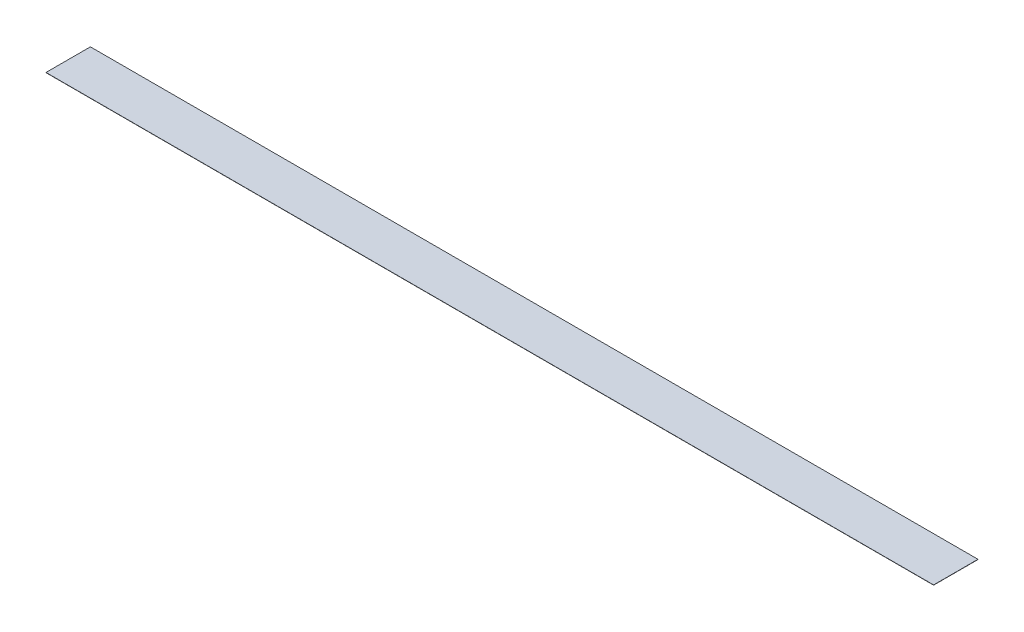
ISO-10303-21;
HEADER;
FILE_DESCRIPTION(('STEP AP214'),'2;1');
FILE_NAME('part.step','',(''),(''),'','','');
FILE_SCHEMA(('AUTOMOTIVE_DESIGN { 1 0 10303 214 1 1 1 1 }'));
ENDSEC;
DATA;
#1=APPLICATION_CONTEXT('core data for automotive mechanical design processes');
#2=APPLICATION_PROTOCOL_DEFINITION('international standard','automotive_design',2000,#1);
#3=PRODUCT_CONTEXT('',#1,'mechanical');
#4=PRODUCT('Part','Part','',(#3));
#5=PRODUCT_RELATED_PRODUCT_CATEGORY('part','',(#4));
#6=PRODUCT_DEFINITION_FORMATION('','',#4);
#7=PRODUCT_DEFINITION_CONTEXT('part definition',#1,'design');
#8=PRODUCT_DEFINITION('design','',#6,#7);
#9=PRODUCT_DEFINITION_SHAPE('','',#8);
#10=(LENGTH_UNIT() NAMED_UNIT(*) SI_UNIT(.MILLI.,.METRE.));
#11=(NAMED_UNIT(*) PLANE_ANGLE_UNIT() SI_UNIT($,.RADIAN.));
#12=(NAMED_UNIT(*) SI_UNIT($,.STERADIAN.) SOLID_ANGLE_UNIT());
#13=UNCERTAINTY_MEASURE_WITH_UNIT(LENGTH_MEASURE(1.E-05),#10,'distance_accuracy_value','');
#14=(GEOMETRIC_REPRESENTATION_CONTEXT(3) GLOBAL_UNCERTAINTY_ASSIGNED_CONTEXT((#13)) GLOBAL_UNIT_ASSIGNED_CONTEXT((#10,
#11,#12)) REPRESENTATION_CONTEXT('',''));
#15=CARTESIAN_POINT('',(0.,0.,0.));
#16=DIRECTION('',(0.,0.,1.));
#17=DIRECTION('',(1.,0.,0.));
#18=AXIS2_PLACEMENT_3D('',#15,#16,#17);
#19=CARTESIAN_POINT('',(508.,0.254,-25.4));
#20=DIRECTION('',(-1.,0.,0.));
#21=DIRECTION('',(0.,0.,1.));
#22=AXIS2_PLACEMENT_3D('',#19,#20,#21);
#23=PLANE('',#22);
#24=DIRECTION('',(0.,0.,-1.));
#25=VECTOR('',#24,1.);
#26=CARTESIAN_POINT('',(508.,0.,-25.4));
#27=LINE('',#26,#25);
#28=CARTESIAN_POINT('',(508.,0.,25.4));
#29=VERTEX_POINT('',#28);
#30=CARTESIAN_POINT('',(508.,0.,-25.4));
#31=VERTEX_POINT('',#30);
#32=EDGE_CURVE('E100',#29,#31,#27,.T.);
#33=ORIENTED_EDGE('',*,*,#32,.T.);
#34=DIRECTION('',(0.,-1.,0.));
#35=VECTOR('',#34,1.);
#36=CARTESIAN_POINT('',(508.,0.254,-25.4));
#37=LINE('',#36,#35);
#38=CARTESIAN_POINT('',(508.,0.254,-25.4));
#39=VERTEX_POINT('',#38);
#40=EDGE_CURVE('E11',#39,#31,#37,.T.);
#41=ORIENTED_EDGE('',*,*,#40,.F.);
#42=DIRECTION('',(0.,0.,-1.));
#43=VECTOR('',#42,1.);
#44=CARTESIAN_POINT('',(508.,0.254,-25.4));
#45=LINE('',#44,#43);
#46=CARTESIAN_POINT('',(508.,0.254,25.4));
#47=VERTEX_POINT('',#46);
#48=EDGE_CURVE('E88',#47,#39,#45,.T.);
#49=ORIENTED_EDGE('',*,*,#48,.F.);
#50=DIRECTION('',(0.,-1.,0.));
#51=VECTOR('',#50,1.);
#52=CARTESIAN_POINT('',(508.,0.254,25.4));
#53=LINE('',#52,#51);
#54=EDGE_CURVE('E96',#47,#29,#53,.T.);
#55=ORIENTED_EDGE('',*,*,#54,.T.);
#56=EDGE_LOOP('',(#33,#41,#49,#55));
#57=FACE_BOUND('',#56,.T.);
#58=ADVANCED_FACE('F37',(#57),#23,.F.);
#59=CARTESIAN_POINT('',(-508.,0.254,-25.4));
#60=DIRECTION('',(0.,0.,1.));
#61=DIRECTION('',(1.,0.,0.));
#62=AXIS2_PLACEMENT_3D('',#59,#60,#61);
#63=PLANE('',#62);
#64=DIRECTION('',(-1.,0.,0.));
#65=VECTOR('',#64,1.);
#66=CARTESIAN_POINT('',(-508.,0.,-25.4));
#67=LINE('',#66,#65);
#68=CARTESIAN_POINT('',(-508.,0.,-25.4));
#69=VERTEX_POINT('',#68);
#70=EDGE_CURVE('E92',#31,#69,#67,.T.);
#71=ORIENTED_EDGE('',*,*,#70,.T.);
#72=DIRECTION('',(0.,-1.,0.));
#73=VECTOR('',#72,1.);
#74=CARTESIAN_POINT('',(-508.,0.254,-25.4));
#75=LINE('',#74,#73);
#76=CARTESIAN_POINT('',(-508.,0.254,-25.4));
#77=VERTEX_POINT('',#76);
#78=EDGE_CURVE('E45',#77,#69,#75,.T.);
#79=ORIENTED_EDGE('',*,*,#78,.F.);
#80=DIRECTION('',(-1.,0.,0.));
#81=VECTOR('',#80,1.);
#82=CARTESIAN_POINT('',(-508.,0.254,-25.4));
#83=LINE('',#82,#81);
#84=EDGE_CURVE('E83',#39,#77,#83,.T.);
#85=ORIENTED_EDGE('',*,*,#84,.F.);
#86=ORIENTED_EDGE('',*,*,#40,.T.);
#87=EDGE_LOOP('',(#71,#79,#85,#86));
#88=FACE_BOUND('',#87,.T.);
#89=ADVANCED_FACE('F91',(#88),#63,.F.);
#90=CARTESIAN_POINT('',(-508.,0.254,-25.4));
#91=DIRECTION('',(1.,0.,0.));
#92=DIRECTION('',(0.,0.,-1.));
#93=AXIS2_PLACEMENT_3D('',#90,#91,#92);
#94=PLANE('',#93);
#95=DIRECTION('',(0.,0.,1.));
#96=VECTOR('',#95,1.);
#97=CARTESIAN_POINT('',(-508.,0.,-25.4));
#98=LINE('',#97,#96);
#99=CARTESIAN_POINT('',(-508.,0.,25.4));
#100=VERTEX_POINT('',#99);
#101=EDGE_CURVE('E70',#69,#100,#98,.T.);
#102=ORIENTED_EDGE('',*,*,#101,.T.);
#103=DIRECTION('',(0.,-1.,0.));
#104=VECTOR('',#103,1.);
#105=CARTESIAN_POINT('',(-508.,0.254,25.4));
#106=LINE('',#105,#104);
#107=CARTESIAN_POINT('',(-508.,0.254,25.4));
#108=VERTEX_POINT('',#107);
#109=EDGE_CURVE('E93',#108,#100,#106,.T.);
#110=ORIENTED_EDGE('',*,*,#109,.F.);
#111=DIRECTION('',(0.,0.,1.));
#112=VECTOR('',#111,1.);
#113=CARTESIAN_POINT('',(-508.,0.254,-25.4));
#114=LINE('',#113,#112);
#115=EDGE_CURVE('E86',#77,#108,#114,.T.);
#116=ORIENTED_EDGE('',*,*,#115,.F.);
#117=ORIENTED_EDGE('',*,*,#78,.T.);
#118=EDGE_LOOP('',(#102,#110,#116,#117));
#119=FACE_BOUND('',#118,.T.);
#120=ADVANCED_FACE('F94',(#119),#94,.F.);
#121=CARTESIAN_POINT('',(-508.,0.254,25.4));
#122=DIRECTION('',(0.,0.,-1.));
#123=DIRECTION('',(-1.,0.,0.));
#124=AXIS2_PLACEMENT_3D('',#121,#122,#123);
#125=PLANE('',#124);
#126=DIRECTION('',(1.,0.,0.));
#127=VECTOR('',#126,1.);
#128=CARTESIAN_POINT('',(-508.,0.,25.4));
#129=LINE('',#128,#127);
#130=EDGE_CURVE('E76',#100,#29,#129,.T.);
#131=ORIENTED_EDGE('',*,*,#130,.T.);
#132=ORIENTED_EDGE('',*,*,#54,.F.);
#133=DIRECTION('',(1.,0.,0.));
#134=VECTOR('',#133,1.);
#135=CARTESIAN_POINT('',(-508.,0.254,25.4));
#136=LINE('',#135,#134);
#137=EDGE_CURVE('E53',#108,#47,#136,.T.);
#138=ORIENTED_EDGE('',*,*,#137,.F.);
#139=ORIENTED_EDGE('',*,*,#109,.T.);
#140=EDGE_LOOP('',(#131,#132,#138,#139));
#141=FACE_BOUND('',#140,.T.);
#142=ADVANCED_FACE('F107',(#141),#125,.F.);
#143=CARTESIAN_POINT('',(0.,0.254,0.));
#144=DIRECTION('',(0.,1.,0.));
#145=DIRECTION('',(0.,0.,1.));
#146=AXIS2_PLACEMENT_3D('',#143,#144,#145);
#147=PLANE('',#146);
#148=ORIENTED_EDGE('',*,*,#48,.T.);
#149=ORIENTED_EDGE('',*,*,#84,.T.);
#150=ORIENTED_EDGE('',*,*,#115,.T.);
#151=ORIENTED_EDGE('',*,*,#137,.T.);
#152=EDGE_LOOP('',(#148,#149,#150,#151));
#153=FACE_BOUND('',#152,.T.);
#154=ADVANCED_FACE('F84',(#153),#147,.T.);
#155=CARTESIAN_POINT('',(0.,0.,0.));
#156=DIRECTION('',(0.,1.,0.));
#157=DIRECTION('',(0.,0.,1.));
#158=AXIS2_PLACEMENT_3D('',#155,#156,#157);
#159=PLANE('',#158);
#160=ORIENTED_EDGE('',*,*,#32,.F.);
#161=ORIENTED_EDGE('',*,*,#130,.F.);
#162=ORIENTED_EDGE('',*,*,#101,.F.);
#163=ORIENTED_EDGE('',*,*,#70,.F.);
#164=EDGE_LOOP('',(#160,#161,#162,#163));
#165=FACE_BOUND('',#164,.T.);
#166=ADVANCED_FACE('F110',(#165),#159,.F.);
#167=CLOSED_SHELL('',(#58,#89,#120,#142,#154,#166));
#168=MANIFOLD_SOLID_BREP('B2',#167);
#169=ADVANCED_BREP_SHAPE_REPRESENTATION('',(#18,#168),#14);
#170=SHAPE_DEFINITION_REPRESENTATION(#9,#169);
ENDSEC;
END-ISO-10303-21;
